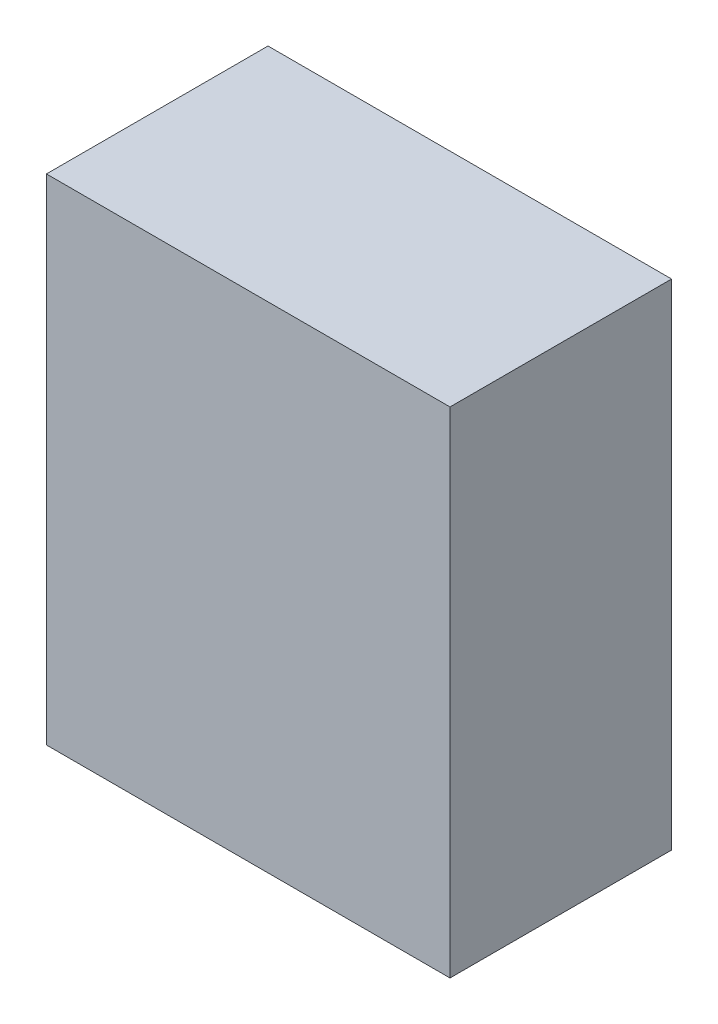
ISO-10303-21;
HEADER;
FILE_DESCRIPTION(('STEP AP214'),'2;1');
FILE_NAME('part.step','',(''),(''),'','','');
FILE_SCHEMA(('AUTOMOTIVE_DESIGN { 1 0 10303 214 1 1 1 1 }'));
ENDSEC;
DATA;
#1=APPLICATION_CONTEXT('core data for automotive mechanical design processes');
#2=APPLICATION_PROTOCOL_DEFINITION('international standard','automotive_design',2000,#1);
#3=PRODUCT_CONTEXT('',#1,'mechanical');
#4=PRODUCT('Part','Part','',(#3));
#5=PRODUCT_RELATED_PRODUCT_CATEGORY('part','',(#4));
#6=PRODUCT_DEFINITION_FORMATION('','',#4);
#7=PRODUCT_DEFINITION_CONTEXT('part definition',#1,'design');
#8=PRODUCT_DEFINITION('design','',#6,#7);
#9=PRODUCT_DEFINITION_SHAPE('','',#8);
#10=(LENGTH_UNIT() NAMED_UNIT(*) SI_UNIT(.MILLI.,.METRE.));
#11=(NAMED_UNIT(*) PLANE_ANGLE_UNIT() SI_UNIT($,.RADIAN.));
#12=(NAMED_UNIT(*) SI_UNIT($,.STERADIAN.) SOLID_ANGLE_UNIT());
#13=UNCERTAINTY_MEASURE_WITH_UNIT(LENGTH_MEASURE(1.E-05),#10,'distance_accuracy_value','');
#14=(GEOMETRIC_REPRESENTATION_CONTEXT(3) GLOBAL_UNCERTAINTY_ASSIGNED_CONTEXT((#13)) GLOBAL_UNIT_ASSIGNED_CONTEXT((#10,
#11,#12)) REPRESENTATION_CONTEXT('',''));
#15=CARTESIAN_POINT('',(0.,0.,0.));
#16=DIRECTION('',(0.,0.,1.));
#17=DIRECTION('',(1.,0.,0.));
#18=AXIS2_PLACEMENT_3D('',#15,#16,#17);
#19=CARTESIAN_POINT('',(25.5,31.25,28.));
#20=DIRECTION('',(-1.,0.,0.));
#21=DIRECTION('',(0.,-1.,0.));
#22=AXIS2_PLACEMENT_3D('',#19,#20,#21);
#23=PLANE('',#22);
#24=DIRECTION('',(0.,1.,0.));
#25=VECTOR('',#24,1.);
#26=CARTESIAN_POINT('',(25.5,31.25,0.));
#27=LINE('',#26,#25);
#28=CARTESIAN_POINT('',(25.5,-31.25,0.));
#29=VERTEX_POINT('',#28);
#30=CARTESIAN_POINT('',(25.5,31.25,0.));
#31=VERTEX_POINT('',#30);
#32=EDGE_CURVE('E107',#29,#31,#27,.T.);
#33=ORIENTED_EDGE('',*,*,#32,.T.);
#34=DIRECTION('',(0.,0.,-1.));
#35=VECTOR('',#34,1.);
#36=CARTESIAN_POINT('',(25.5,31.25,28.));
#37=LINE('',#36,#35);
#38=CARTESIAN_POINT('',(25.5,31.25,28.));
#39=VERTEX_POINT('',#38);
#40=EDGE_CURVE('E11',#39,#31,#37,.T.);
#41=ORIENTED_EDGE('',*,*,#40,.F.);
#42=DIRECTION('',(0.,1.,0.));
#43=VECTOR('',#42,1.);
#44=CARTESIAN_POINT('',(25.5,31.25,28.));
#45=LINE('',#44,#43);
#46=CARTESIAN_POINT('',(25.5,-31.25,28.));
#47=VERTEX_POINT('',#46);
#48=EDGE_CURVE('E91',#47,#39,#45,.T.);
#49=ORIENTED_EDGE('',*,*,#48,.F.);
#50=DIRECTION('',(0.,0.,-1.));
#51=VECTOR('',#50,1.);
#52=CARTESIAN_POINT('',(25.5,-31.25,28.));
#53=LINE('',#52,#51);
#54=EDGE_CURVE('E103',#47,#29,#53,.T.);
#55=ORIENTED_EDGE('',*,*,#54,.T.);
#56=EDGE_LOOP('',(#33,#41,#49,#55));
#57=FACE_BOUND('',#56,.T.);
#58=ADVANCED_FACE('F39',(#57),#23,.F.);
#59=CARTESIAN_POINT('',(-25.5,31.25,28.));
#60=DIRECTION('',(0.,-1.,0.));
#61=DIRECTION('',(0.,0.,-1.));
#62=AXIS2_PLACEMENT_3D('',#59,#60,#61);
#63=PLANE('',#62);
#64=DIRECTION('',(-1.,0.,0.));
#65=VECTOR('',#64,1.);
#66=CARTESIAN_POINT('',(-25.5,31.25,0.));
#67=LINE('',#66,#65);
#68=CARTESIAN_POINT('',(-25.5,31.25,0.));
#69=VERTEX_POINT('',#68);
#70=EDGE_CURVE('E96',#31,#69,#67,.T.);
#71=ORIENTED_EDGE('',*,*,#70,.T.);
#72=DIRECTION('',(0.,0.,-1.));
#73=VECTOR('',#72,1.);
#74=CARTESIAN_POINT('',(-25.5,31.25,28.));
#75=LINE('',#74,#73);
#76=CARTESIAN_POINT('',(-25.5,31.25,28.));
#77=VERTEX_POINT('',#76);
#78=EDGE_CURVE('E48',#77,#69,#75,.T.);
#79=ORIENTED_EDGE('',*,*,#78,.F.);
#80=DIRECTION('',(-1.,0.,0.));
#81=VECTOR('',#80,1.);
#82=CARTESIAN_POINT('',(-25.5,31.25,28.));
#83=LINE('',#82,#81);
#84=EDGE_CURVE('E86',#39,#77,#83,.T.);
#85=ORIENTED_EDGE('',*,*,#84,.F.);
#86=ORIENTED_EDGE('',*,*,#40,.T.);
#87=EDGE_LOOP('',(#71,#79,#85,#86));
#88=FACE_BOUND('',#87,.T.);
#89=ADVANCED_FACE('F95',(#88),#63,.F.);
#90=CARTESIAN_POINT('',(-25.5,31.25,28.));
#91=DIRECTION('',(1.,0.,0.));
#92=DIRECTION('',(0.,1.,0.));
#93=AXIS2_PLACEMENT_3D('',#90,#91,#92);
#94=PLANE('',#93);
#95=DIRECTION('',(0.,-1.,0.));
#96=VECTOR('',#95,1.);
#97=CARTESIAN_POINT('',(-25.5,31.25,0.));
#98=LINE('',#97,#96);
#99=CARTESIAN_POINT('',(-25.5,-31.25,0.));
#100=VERTEX_POINT('',#99);
#101=EDGE_CURVE('E73',#69,#100,#98,.T.);
#102=ORIENTED_EDGE('',*,*,#101,.T.);
#103=DIRECTION('',(0.,0.,-1.));
#104=VECTOR('',#103,1.);
#105=CARTESIAN_POINT('',(-25.5,-31.25,28.));
#106=LINE('',#105,#104);
#107=CARTESIAN_POINT('',(-25.5,-31.25,28.));
#108=VERTEX_POINT('',#107);
#109=EDGE_CURVE('E98',#108,#100,#106,.T.);
#110=ORIENTED_EDGE('',*,*,#109,.F.);
#111=DIRECTION('',(0.,-1.,0.));
#112=VECTOR('',#111,1.);
#113=CARTESIAN_POINT('',(-25.5,31.25,28.));
#114=LINE('',#113,#112);
#115=EDGE_CURVE('E89',#77,#108,#114,.T.);
#116=ORIENTED_EDGE('',*,*,#115,.F.);
#117=ORIENTED_EDGE('',*,*,#78,.T.);
#118=EDGE_LOOP('',(#102,#110,#116,#117));
#119=FACE_BOUND('',#118,.T.);
#120=ADVANCED_FACE('F99',(#119),#94,.F.);
#121=CARTESIAN_POINT('',(-25.5,-31.25,28.));
#122=DIRECTION('',(0.,1.,0.));
#123=DIRECTION('',(0.,0.,1.));
#124=AXIS2_PLACEMENT_3D('',#121,#122,#123);
#125=PLANE('',#124);
#126=DIRECTION('',(1.,0.,0.));
#127=VECTOR('',#126,1.);
#128=CARTESIAN_POINT('',(-25.5,-31.25,0.));
#129=LINE('',#128,#127);
#130=EDGE_CURVE('E79',#100,#29,#129,.T.);
#131=ORIENTED_EDGE('',*,*,#130,.T.);
#132=ORIENTED_EDGE('',*,*,#54,.F.);
#133=DIRECTION('',(1.,0.,0.));
#134=VECTOR('',#133,1.);
#135=CARTESIAN_POINT('',(-25.5,-31.25,28.));
#136=LINE('',#135,#134);
#137=EDGE_CURVE('E56',#108,#47,#136,.T.);
#138=ORIENTED_EDGE('',*,*,#137,.F.);
#139=ORIENTED_EDGE('',*,*,#109,.T.);
#140=EDGE_LOOP('',(#131,#132,#138,#139));
#141=FACE_BOUND('',#140,.T.);
#142=ADVANCED_FACE('F120',(#141),#125,.F.);
#143=CARTESIAN_POINT('',(0.,0.,28.));
#144=DIRECTION('',(0.,0.,1.));
#145=DIRECTION('',(1.,0.,0.));
#146=AXIS2_PLACEMENT_3D('',#143,#144,#145);
#147=PLANE('',#146);
#148=ORIENTED_EDGE('',*,*,#48,.T.);
#149=ORIENTED_EDGE('',*,*,#84,.T.);
#150=ORIENTED_EDGE('',*,*,#115,.T.);
#151=ORIENTED_EDGE('',*,*,#137,.T.);
#152=EDGE_LOOP('',(#148,#149,#150,#151));
#153=FACE_BOUND('',#152,.T.);
#154=ADVANCED_FACE('F87',(#153),#147,.T.);
#155=CARTESIAN_POINT('',(0.,0.,0.));
#156=DIRECTION('',(0.,0.,1.));
#157=DIRECTION('',(1.,0.,0.));
#158=AXIS2_PLACEMENT_3D('',#155,#156,#157);
#159=PLANE('',#158);
#160=ORIENTED_EDGE('',*,*,#32,.F.);
#161=ORIENTED_EDGE('',*,*,#130,.F.);
#162=ORIENTED_EDGE('',*,*,#101,.F.);
#163=ORIENTED_EDGE('',*,*,#70,.F.);
#164=EDGE_LOOP('',(#160,#161,#162,#163));
#165=FACE_BOUND('',#164,.T.);
#166=ADVANCED_FACE('F123',(#165),#159,.F.);
#167=CLOSED_SHELL('',(#58,#89,#120,#142,#154,#166));
#168=MANIFOLD_SOLID_BREP('B2',#167);
#169=ADVANCED_BREP_SHAPE_REPRESENTATION('',(#18,#168),#14);
#170=SHAPE_DEFINITION_REPRESENTATION(#9,#169);
ENDSEC;
END-ISO-10303-21;
